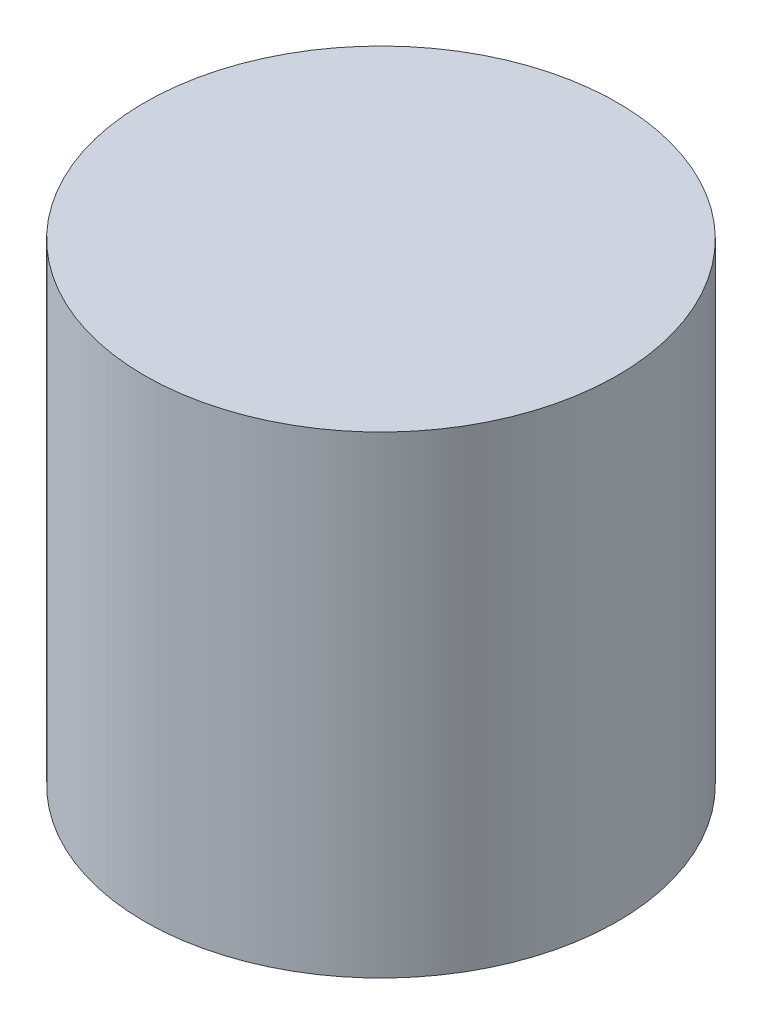
ISO-10303-21;
HEADER;
FILE_DESCRIPTION(('STEP AP214'),'2;1');
FILE_NAME('part.step','',(''),(''),'','','');
FILE_SCHEMA(('AUTOMOTIVE_DESIGN { 1 0 10303 214 1 1 1 1 }'));
ENDSEC;
DATA;
#1=APPLICATION_CONTEXT('core data for automotive mechanical design processes');
#2=APPLICATION_PROTOCOL_DEFINITION('international standard','automotive_design',2000,#1);
#3=PRODUCT_CONTEXT('',#1,'mechanical');
#4=PRODUCT('Part','Part','',(#3));
#5=PRODUCT_RELATED_PRODUCT_CATEGORY('part','',(#4));
#6=PRODUCT_DEFINITION_FORMATION('','',#4);
#7=PRODUCT_DEFINITION_CONTEXT('part definition',#1,'design');
#8=PRODUCT_DEFINITION('design','',#6,#7);
#9=PRODUCT_DEFINITION_SHAPE('','',#8);
#10=(LENGTH_UNIT() NAMED_UNIT(*) SI_UNIT(.MILLI.,.METRE.));
#11=(NAMED_UNIT(*) PLANE_ANGLE_UNIT() SI_UNIT($,.RADIAN.));
#12=(NAMED_UNIT(*) SI_UNIT($,.STERADIAN.) SOLID_ANGLE_UNIT());
#13=UNCERTAINTY_MEASURE_WITH_UNIT(LENGTH_MEASURE(1.E-05),#10,'distance_accuracy_value','');
#14=(GEOMETRIC_REPRESENTATION_CONTEXT(3) GLOBAL_UNCERTAINTY_ASSIGNED_CONTEXT((#13)) GLOBAL_UNIT_ASSIGNED_CONTEXT((#10,
#11,#12)) REPRESENTATION_CONTEXT('',''));
#15=CARTESIAN_POINT('',(0.,0.,0.));
#16=DIRECTION('',(0.,0.,1.));
#17=DIRECTION('',(1.,0.,0.));
#18=AXIS2_PLACEMENT_3D('',#15,#16,#17);
#19=CARTESIAN_POINT('',(0.,50.8,0.));
#20=DIRECTION('',(0.,-1.,0.));
#21=DIRECTION('',(0.,0.,-1.));
#22=AXIS2_PLACEMENT_3D('',#19,#20,#21);
#23=CYLINDRICAL_SURFACE('',#22,25.4);
#24=CARTESIAN_POINT('',(0.,50.8,0.));
#25=DIRECTION('',(0.,1.,0.));
#26=DIRECTION('',(0.,0.,1.));
#27=AXIS2_PLACEMENT_3D('',#24,#25,#26);
#28=CIRCLE('',#27,25.4);
#29=CARTESIAN_POINT('',(0.,50.8,25.4));
#30=VERTEX_POINT('',#29);
#31=EDGE_CURVE('E10',#30,#30,#28,.T.);
#32=ORIENTED_EDGE('',*,*,#31,.F.);
#33=EDGE_LOOP('',(#32));
#34=FACE_BOUND('',#33,.T.);
#35=CARTESIAN_POINT('',(0.,0.,0.));
#36=DIRECTION('',(0.,1.,0.));
#37=DIRECTION('',(0.,0.,1.));
#38=AXIS2_PLACEMENT_3D('',#35,#36,#37);
#39=CIRCLE('',#38,25.4);
#40=CARTESIAN_POINT('',(0.,0.,25.4));
#41=VERTEX_POINT('',#40);
#42=EDGE_CURVE('E34',#41,#41,#39,.T.);
#43=ORIENTED_EDGE('',*,*,#42,.T.);
#44=EDGE_LOOP('',(#43));
#45=FACE_BOUND('',#44,.T.);
#46=ADVANCED_FACE('F31',(#34,#45),#23,.T.);
#47=CARTESIAN_POINT('',(0.,50.8,0.));
#48=DIRECTION('',(0.,1.,0.));
#49=DIRECTION('',(0.,0.,1.));
#50=AXIS2_PLACEMENT_3D('',#47,#48,#49);
#51=PLANE('',#50);
#52=ORIENTED_EDGE('',*,*,#31,.T.);
#53=EDGE_LOOP('',(#52));
#54=FACE_BOUND('',#53,.T.);
#55=ADVANCED_FACE('F46',(#54),#51,.T.);
#56=CARTESIAN_POINT('',(0.,0.,0.));
#57=DIRECTION('',(0.,1.,0.));
#58=DIRECTION('',(0.,0.,1.));
#59=AXIS2_PLACEMENT_3D('',#56,#57,#58);
#60=PLANE('',#59);
#61=ORIENTED_EDGE('',*,*,#42,.F.);
#62=EDGE_LOOP('',(#61));
#63=FACE_BOUND('',#62,.T.);
#64=ADVANCED_FACE('F44',(#63),#60,.F.);
#65=CLOSED_SHELL('',(#46,#55,#64));
#66=MANIFOLD_SOLID_BREP('B2',#65);
#67=ADVANCED_BREP_SHAPE_REPRESENTATION('',(#18,#66),#14);
#68=SHAPE_DEFINITION_REPRESENTATION(#9,#67);
ENDSEC;
END-ISO-10303-21;
